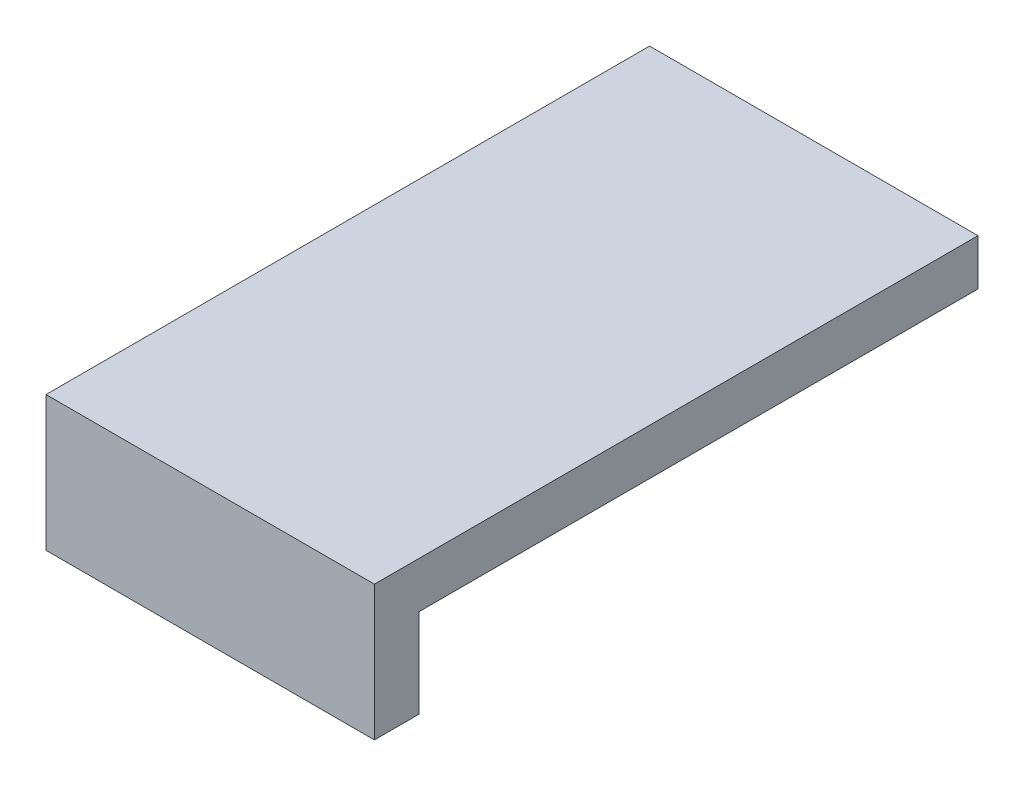
ISO-10303-21;
HEADER;
FILE_DESCRIPTION(('STEP AP214'),'2;1');
FILE_NAME('part.step','',(''),(''),'','','');
FILE_SCHEMA(('AUTOMOTIVE_DESIGN { 1 0 10303 214 1 1 1 1 }'));
ENDSEC;
DATA;
#1=APPLICATION_CONTEXT('core data for automotive mechanical design processes');
#2=APPLICATION_PROTOCOL_DEFINITION('international standard','automotive_design',2000,#1);
#3=PRODUCT_CONTEXT('',#1,'mechanical');
#4=PRODUCT('Part','Part','',(#3));
#5=PRODUCT_RELATED_PRODUCT_CATEGORY('part','',(#4));
#6=PRODUCT_DEFINITION_FORMATION('','',#4);
#7=PRODUCT_DEFINITION_CONTEXT('part definition',#1,'design');
#8=PRODUCT_DEFINITION('design','',#6,#7);
#9=PRODUCT_DEFINITION_SHAPE('','',#8);
#10=(LENGTH_UNIT() NAMED_UNIT(*) SI_UNIT(.MILLI.,.METRE.));
#11=(NAMED_UNIT(*) PLANE_ANGLE_UNIT() SI_UNIT($,.RADIAN.));
#12=(NAMED_UNIT(*) SI_UNIT($,.STERADIAN.) SOLID_ANGLE_UNIT());
#13=UNCERTAINTY_MEASURE_WITH_UNIT(LENGTH_MEASURE(1.E-05),#10,'distance_accuracy_value','');
#14=(GEOMETRIC_REPRESENTATION_CONTEXT(3) GLOBAL_UNCERTAINTY_ASSIGNED_CONTEXT((#13)) GLOBAL_UNIT_ASSIGNED_CONTEXT((#10,
#11,#12)) REPRESENTATION_CONTEXT('',''));
#15=CARTESIAN_POINT('',(0.,0.,0.));
#16=DIRECTION('',(0.,0.,1.));
#17=DIRECTION('',(1.,0.,0.));
#18=AXIS2_PLACEMENT_3D('',#15,#16,#17);
#19=CARTESIAN_POINT('',(9.25,2.6,17.));
#20=DIRECTION('',(-1.,0.,0.));
#21=DIRECTION('',(0.,0.,1.));
#22=AXIS2_PLACEMENT_3D('',#19,#20,#21);
#23=PLANE('',#22);
#24=DIRECTION('',(0.,-1.,0.));
#25=VECTOR('',#24,1.);
#26=CARTESIAN_POINT('',(9.25,2.6,17.));
#27=LINE('',#26,#25);
#28=CARTESIAN_POINT('',(9.25,2.6,17.));
#29=VERTEX_POINT('',#28);
#30=CARTESIAN_POINT('',(9.25,-5.,17.));
#31=VERTEX_POINT('',#30);
#32=EDGE_CURVE('E130',#29,#31,#27,.T.);
#33=ORIENTED_EDGE('',*,*,#32,.T.);
#34=DIRECTION('',(0.,0.,1.));
#35=VECTOR('',#34,1.);
#36=CARTESIAN_POINT('',(9.25,-5.,17.));
#37=LINE('',#36,#35);
#38=CARTESIAN_POINT('',(9.25,-5.,14.5));
#39=VERTEX_POINT('',#38);
#40=EDGE_CURVE('E106',#39,#31,#37,.T.);
#41=ORIENTED_EDGE('',*,*,#40,.F.);
#42=DIRECTION('',(0.,1.,0.));
#43=VECTOR('',#42,1.);
#44=CARTESIAN_POINT('',(9.25,-5.,14.5));
#45=LINE('',#44,#43);
#46=CARTESIAN_POINT('',(9.25,0.,14.5));
#47=VERTEX_POINT('',#46);
#48=EDGE_CURVE('E102',#39,#47,#45,.T.);
#49=ORIENTED_EDGE('',*,*,#48,.T.);
#50=DIRECTION('',(0.,0.,-1.));
#51=VECTOR('',#50,1.);
#52=CARTESIAN_POINT('',(9.25,0.,17.));
#53=LINE('',#52,#51);
#54=CARTESIAN_POINT('',(9.25,0.,-17.));
#55=VERTEX_POINT('',#54);
#56=EDGE_CURVE('E119',#47,#55,#53,.T.);
#57=ORIENTED_EDGE('',*,*,#56,.T.);
#58=DIRECTION('',(0.,-1.,0.));
#59=VECTOR('',#58,1.);
#60=CARTESIAN_POINT('',(9.25,2.6,-17.));
#61=LINE('',#60,#59);
#62=CARTESIAN_POINT('',(9.25,2.6,-17.));
#63=VERTEX_POINT('',#62);
#64=EDGE_CURVE('E11',#63,#55,#61,.T.);
#65=ORIENTED_EDGE('',*,*,#64,.F.);
#66=DIRECTION('',(0.,0.,-1.));
#67=VECTOR('',#66,1.);
#68=CARTESIAN_POINT('',(9.25,2.6,17.));
#69=LINE('',#68,#67);
#70=EDGE_CURVE('E125',#29,#63,#69,.T.);
#71=ORIENTED_EDGE('',*,*,#70,.F.);
#72=EDGE_LOOP('',(#33,#41,#49,#57,#65,#71));
#73=FACE_BOUND('',#72,.T.);
#74=ADVANCED_FACE('F36',(#73),#23,.F.);
#75=CARTESIAN_POINT('',(-9.25,2.6,-17.));
#76=DIRECTION('',(0.,0.,1.));
#77=DIRECTION('',(1.,0.,0.));
#78=AXIS2_PLACEMENT_3D('',#75,#76,#77);
#79=PLANE('',#78);
#80=DIRECTION('',(-1.,0.,0.));
#81=VECTOR('',#80,1.);
#82=CARTESIAN_POINT('',(-9.25,0.,-17.));
#83=LINE('',#82,#81);
#84=CARTESIAN_POINT('',(-9.25,0.,-17.));
#85=VERTEX_POINT('',#84);
#86=EDGE_CURVE('E74',#55,#85,#83,.T.);
#87=ORIENTED_EDGE('',*,*,#86,.T.);
#88=DIRECTION('',(0.,-1.,0.));
#89=VECTOR('',#88,1.);
#90=CARTESIAN_POINT('',(-9.25,2.6,-17.));
#91=LINE('',#90,#89);
#92=CARTESIAN_POINT('',(-9.25,2.6,-17.));
#93=VERTEX_POINT('',#92);
#94=EDGE_CURVE('E43',#93,#85,#91,.T.);
#95=ORIENTED_EDGE('',*,*,#94,.F.);
#96=DIRECTION('',(-1.,0.,0.));
#97=VECTOR('',#96,1.);
#98=CARTESIAN_POINT('',(-9.25,2.6,-17.));
#99=LINE('',#98,#97);
#100=EDGE_CURVE('E79',#63,#93,#99,.T.);
#101=ORIENTED_EDGE('',*,*,#100,.F.);
#102=ORIENTED_EDGE('',*,*,#64,.T.);
#103=EDGE_LOOP('',(#87,#95,#101,#102));
#104=FACE_BOUND('',#103,.T.);
#105=ADVANCED_FACE('F139',(#104),#79,.F.);
#106=CARTESIAN_POINT('',(-9.25,2.6,17.));
#107=DIRECTION('',(1.,0.,0.));
#108=DIRECTION('',(0.,0.,-1.));
#109=AXIS2_PLACEMENT_3D('',#106,#107,#108);
#110=PLANE('',#109);
#111=DIRECTION('',(0.,0.,1.));
#112=VECTOR('',#111,1.);
#113=CARTESIAN_POINT('',(-9.25,0.,17.));
#114=LINE('',#113,#112);
#115=CARTESIAN_POINT('',(-9.25,0.,14.5));
#116=VERTEX_POINT('',#115);
#117=EDGE_CURVE('E118',#85,#116,#114,.T.);
#118=ORIENTED_EDGE('',*,*,#117,.T.);
#119=DIRECTION('',(0.,1.,0.));
#120=VECTOR('',#119,1.);
#121=CARTESIAN_POINT('',(-9.25,-5.,14.5));
#122=LINE('',#121,#120);
#123=CARTESIAN_POINT('',(-9.25,-5.,14.5));
#124=VERTEX_POINT('',#123);
#125=EDGE_CURVE('E100',#124,#116,#122,.T.);
#126=ORIENTED_EDGE('',*,*,#125,.F.);
#127=DIRECTION('',(0.,0.,-1.));
#128=VECTOR('',#127,1.);
#129=CARTESIAN_POINT('',(-9.25,-5.,17.));
#130=LINE('',#129,#128);
#131=CARTESIAN_POINT('',(-9.25,-5.,17.));
#132=VERTEX_POINT('',#131);
#133=EDGE_CURVE('E107',#132,#124,#130,.T.);
#134=ORIENTED_EDGE('',*,*,#133,.F.);
#135=DIRECTION('',(0.,-1.,0.));
#136=VECTOR('',#135,1.);
#137=CARTESIAN_POINT('',(-9.25,2.6,17.));
#138=LINE('',#137,#136);
#139=CARTESIAN_POINT('',(-9.25,2.6,17.));
#140=VERTEX_POINT('',#139);
#141=EDGE_CURVE('E135',#140,#132,#138,.T.);
#142=ORIENTED_EDGE('',*,*,#141,.F.);
#143=DIRECTION('',(0.,0.,1.));
#144=VECTOR('',#143,1.);
#145=CARTESIAN_POINT('',(-9.25,2.6,17.));
#146=LINE('',#145,#144);
#147=EDGE_CURVE('E128',#93,#140,#146,.T.);
#148=ORIENTED_EDGE('',*,*,#147,.F.);
#149=ORIENTED_EDGE('',*,*,#94,.T.);
#150=EDGE_LOOP('',(#118,#126,#134,#142,#148,#149));
#151=FACE_BOUND('',#150,.T.);
#152=ADVANCED_FACE('F117',(#151),#110,.F.);
#153=CARTESIAN_POINT('',(-9.25,2.6,17.));
#154=DIRECTION('',(0.,0.,-1.));
#155=DIRECTION('',(-1.,0.,0.));
#156=AXIS2_PLACEMENT_3D('',#153,#154,#155);
#157=PLANE('',#156);
#158=ORIENTED_EDGE('',*,*,#141,.T.);
#159=DIRECTION('',(-1.,0.,0.));
#160=VECTOR('',#159,1.);
#161=CARTESIAN_POINT('',(-9.25,-5.,17.));
#162=LINE('',#161,#160);
#163=EDGE_CURVE('E113',#31,#132,#162,.T.);
#164=ORIENTED_EDGE('',*,*,#163,.F.);
#165=ORIENTED_EDGE('',*,*,#32,.F.);
#166=DIRECTION('',(1.,0.,0.));
#167=VECTOR('',#166,1.);
#168=CARTESIAN_POINT('',(-9.25,2.6,17.));
#169=LINE('',#168,#167);
#170=EDGE_CURVE('E59',#140,#29,#169,.T.);
#171=ORIENTED_EDGE('',*,*,#170,.F.);
#172=EDGE_LOOP('',(#158,#164,#165,#171));
#173=FACE_BOUND('',#172,.T.);
#174=ADVANCED_FACE('F145',(#173),#157,.F.);
#175=CARTESIAN_POINT('',(0.,2.6,0.));
#176=DIRECTION('',(0.,-1.,0.));
#177=DIRECTION('',(0.,0.,-1.));
#178=AXIS2_PLACEMENT_3D('',#175,#176,#177);
#179=PLANE('',#178);
#180=ORIENTED_EDGE('',*,*,#70,.T.);
#181=ORIENTED_EDGE('',*,*,#100,.T.);
#182=ORIENTED_EDGE('',*,*,#147,.T.);
#183=ORIENTED_EDGE('',*,*,#170,.T.);
#184=EDGE_LOOP('',(#180,#181,#182,#183));
#185=FACE_BOUND('',#184,.T.);
#186=ADVANCED_FACE('F147',(#185),#179,.F.);
#187=CARTESIAN_POINT('',(0.,0.,0.));
#188=DIRECTION('',(0.,-1.,0.));
#189=DIRECTION('',(0.,0.,-1.));
#190=AXIS2_PLACEMENT_3D('',#187,#188,#189);
#191=PLANE('',#190);
#192=DIRECTION('',(1.,0.,0.));
#193=VECTOR('',#192,1.);
#194=CARTESIAN_POINT('',(-9.25,0.,14.5));
#195=LINE('',#194,#193);
#196=EDGE_CURVE('E50',#116,#47,#195,.T.);
#197=ORIENTED_EDGE('',*,*,#196,.F.);
#198=ORIENTED_EDGE('',*,*,#117,.F.);
#199=ORIENTED_EDGE('',*,*,#86,.F.);
#200=ORIENTED_EDGE('',*,*,#56,.F.);
#201=EDGE_LOOP('',(#197,#198,#199,#200));
#202=FACE_BOUND('',#201,.T.);
#203=ADVANCED_FACE('F137',(#202),#191,.T.);
#204=CARTESIAN_POINT('',(-9.25,-5.,14.5));
#205=DIRECTION('',(0.,0.,1.));
#206=DIRECTION('',(1.,0.,0.));
#207=AXIS2_PLACEMENT_3D('',#204,#205,#206);
#208=PLANE('',#207);
#209=ORIENTED_EDGE('',*,*,#196,.T.);
#210=ORIENTED_EDGE('',*,*,#48,.F.);
#211=DIRECTION('',(1.,0.,0.));
#212=VECTOR('',#211,1.);
#213=CARTESIAN_POINT('',(-9.25,-5.,14.5));
#214=LINE('',#213,#212);
#215=EDGE_CURVE('E96',#124,#39,#214,.T.);
#216=ORIENTED_EDGE('',*,*,#215,.F.);
#217=ORIENTED_EDGE('',*,*,#125,.T.);
#218=EDGE_LOOP('',(#209,#210,#216,#217));
#219=FACE_BOUND('',#218,.T.);
#220=ADVANCED_FACE('F98',(#219),#208,.F.);
#221=CARTESIAN_POINT('',(0.,-5.,0.));
#222=DIRECTION('',(0.,-1.,0.));
#223=DIRECTION('',(0.,0.,-1.));
#224=AXIS2_PLACEMENT_3D('',#221,#222,#223);
#225=PLANE('',#224);
#226=ORIENTED_EDGE('',*,*,#133,.T.);
#227=ORIENTED_EDGE('',*,*,#215,.T.);
#228=ORIENTED_EDGE('',*,*,#40,.T.);
#229=ORIENTED_EDGE('',*,*,#163,.T.);
#230=EDGE_LOOP('',(#226,#227,#228,#229));
#231=FACE_BOUND('',#230,.T.);
#232=ADVANCED_FACE('F111',(#231),#225,.T.);
#233=CLOSED_SHELL('',(#74,#105,#152,#174,#186,#203,#220,#232));
#234=MANIFOLD_SOLID_BREP('B2',#233);
#235=ADVANCED_BREP_SHAPE_REPRESENTATION('',(#18,#234),#14);
#236=SHAPE_DEFINITION_REPRESENTATION(#9,#235);
ENDSEC;
END-ISO-10303-21;
